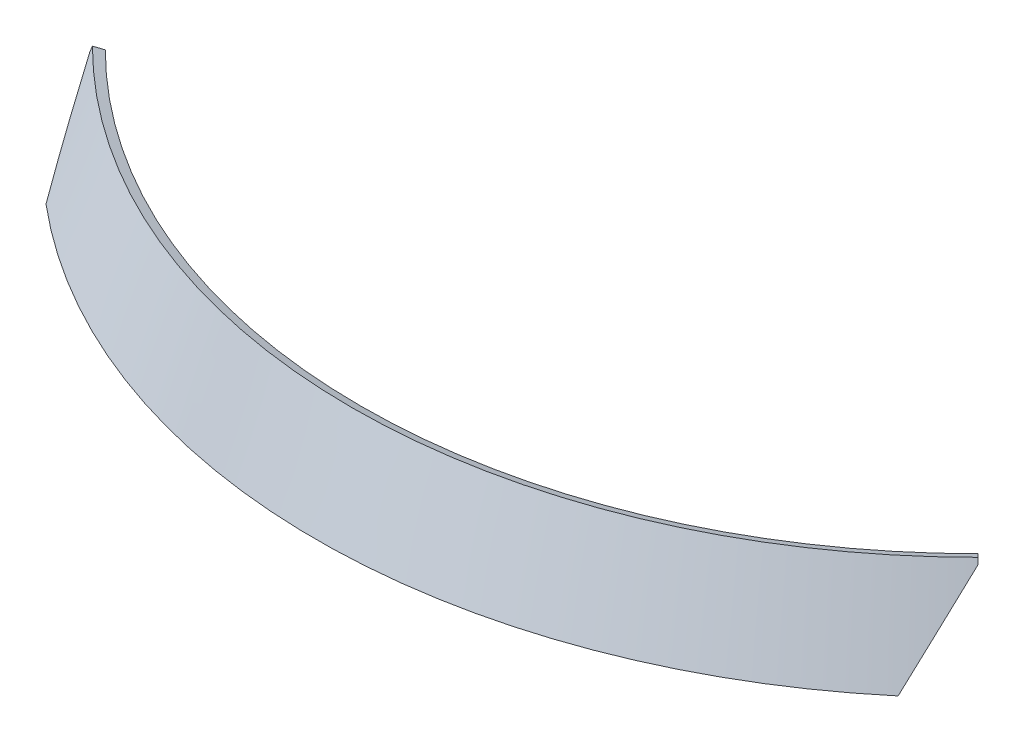
ISO-10303-21;
HEADER;
FILE_DESCRIPTION(('STEP AP214'),'2;1');
FILE_NAME('part.step','',(''),(''),'','','');
FILE_SCHEMA(('AUTOMOTIVE_DESIGN { 1 0 10303 214 1 1 1 1 }'));
ENDSEC;
DATA;
#1=APPLICATION_CONTEXT('core data for automotive mechanical design processes');
#2=APPLICATION_PROTOCOL_DEFINITION('international standard','automotive_design',2000,#1);
#3=PRODUCT_CONTEXT('',#1,'mechanical');
#4=PRODUCT('Part','Part','',(#3));
#5=PRODUCT_RELATED_PRODUCT_CATEGORY('part','',(#4));
#6=PRODUCT_DEFINITION_FORMATION('','',#4);
#7=PRODUCT_DEFINITION_CONTEXT('part definition',#1,'design');
#8=PRODUCT_DEFINITION('design','',#6,#7);
#9=PRODUCT_DEFINITION_SHAPE('','',#8);
#10=(LENGTH_UNIT() NAMED_UNIT(*) SI_UNIT(.MILLI.,.METRE.));
#11=(NAMED_UNIT(*) PLANE_ANGLE_UNIT() SI_UNIT($,.RADIAN.));
#12=(NAMED_UNIT(*) SI_UNIT($,.STERADIAN.) SOLID_ANGLE_UNIT());
#13=UNCERTAINTY_MEASURE_WITH_UNIT(LENGTH_MEASURE(1.E-05),#10,'distance_accuracy_value','');
#14=(GEOMETRIC_REPRESENTATION_CONTEXT(3) GLOBAL_UNCERTAINTY_ASSIGNED_CONTEXT((#13)) GLOBAL_UNIT_ASSIGNED_CONTEXT((#10,
#11,#12)) REPRESENTATION_CONTEXT('',''));
#15=CARTESIAN_POINT('',(0.,0.,0.));
#16=DIRECTION('',(0.,0.,1.));
#17=DIRECTION('',(1.,0.,0.));
#18=AXIS2_PLACEMENT_3D('',#15,#16,#17);
#19=CARTESIAN_POINT('',(102.475807338383,-51.8405545574326,102.461665202759));
#20=DIRECTION('',(0.707106781186546,0.,-0.707106781186549));
#21=DIRECTION('',(-0.707106781186549,0.,-0.707106781186546));
#22=AXIS2_PLACEMENT_3D('',#19,#20,#21);
#23=PLANE('',#22);
#24=CARTESIAN_POINT('',(137.185786618003,7.42461647718073E-13,137.171644482379));
#25=DIRECTION('',(0.24184463948598,-0.939692684181266,0.24184463948598));
#26=VECTOR('',#25,1.);
#27=LINE('',#24,#26);
#28=CARTESIAN_POINT('',(137.184215223104,-7.64684897387979E-09,137.173215784284));
#29=VERTEX_POINT('',#28);
#30=CARTESIAN_POINT('',(137.59332327154,-1.5909724984819,137.583031660133));
#31=VERTEX_POINT('',#30);
#32=EDGE_CURVE('E401',#29,#31,#27,.T.);
#33=ORIENTED_EDGE('',*,*,#32,.T.);
#34=CARTESIAN_POINT('',(135.59780694337,-2.60843124027721,135.587339220933));
#35=CARTESIAN_POINT('',(135.69002345683,-2.56061711371758,135.679046865345));
#36=CARTESIAN_POINT('',(135.782224191703,-2.51289028459415,135.770815948088));
#37=CARTESIAN_POINT('',(135.964012036282,-2.41896108475901,135.951919802834));
#38=CARTESIAN_POINT('',(136.053600109701,-2.37275341661319,136.041250860278));
#39=CARTESIAN_POINT('',(136.230162715626,-2.28186239242355,136.217478518782));
#40=CARTESIAN_POINT('',(136.317138272512,-2.23717343484836,136.304371203791));
#41=CARTESIAN_POINT('',(136.488475789723,-2.14932035264304,136.475722413791));
#42=CARTESIAN_POINT('',(136.57283884535,-2.10615027533361,136.560176791064));
#43=CARTESIAN_POINT('',(136.738951334365,-2.02133531558978,136.726651579694));
#44=CARTESIAN_POINT('',(136.820701940391,-1.97968410173249,136.808667594535));
#45=CARTESIAN_POINT('',(136.98158946687,-1.89790739301199,136.970265959196));
#46=CARTESIAN_POINT('',(137.06072764675,-1.85777514677486,137.049843637965));
#47=CARTESIAN_POINT('',(137.216390317221,-1.77903661235138,137.20656545125));
#48=CARTESIAN_POINT('',(137.292916161679,-1.74042312078384,137.283704620588));
#49=CARTESIAN_POINT('',(137.443353901609,-1.66472348826077,137.43555027401));
#50=CARTESIAN_POINT('',(137.517267264821,-1.62762960719847,137.510251445916));
#51=CARTESIAN_POINT('',(137.591157702123,-1.5906557828645,137.585034732665));
#52=B_SPLINE_CURVE_WITH_KNOTS('',3,(#34,#35,#36,#37,#38,#39,#40,#41,#42,#43,#44,#45,#46,#47,#48,
#49,#50,#51),.UNSPECIFIED.,.F.,.F.,(4,2,2,2,2,2,2,2,4),(0.,0.415696191702338,0.819763919657076,
1.21220439536273,1.5930189435731,1.96220901626367,2.31977620888646,2.6657222793722,
3.00004917044658),.UNSPECIFIED.);
#53=CARTESIAN_POINT('',(135.598059960483,-2.60770232133713,135.586713249244));
#54=VERTEX_POINT('',#53);
#55=EDGE_CURVE('E134',#54,#31,#52,.T.);
#56=ORIENTED_EDGE('',*,*,#55,.F.);
#57=CARTESIAN_POINT('',(135.599398662294,-2.60747157131038,135.58525652667));
#58=DIRECTION('',(-0.241844755973567,0.939692624221437,-0.241844755973567));
#59=VECTOR('',#58,1.);
#60=LINE('',#57,#59);
#61=CARTESIAN_POINT('',(135.190693365206,-1.02606086442858,135.179959763885));
#62=VERTEX_POINT('',#61);
#63=EDGE_CURVE('E130',#54,#62,#60,.T.);
#64=ORIENTED_EDGE('',*,*,#63,.T.);
#65=DIRECTION('',(0.66446302441487,0.342020143223885,0.66446302441487));
#66=VECTOR('',#65,1.);
#67=CARTESIAN_POINT('',(135.192397539428,-1.02606040896335,135.178255403804));
#68=LINE('',#67,#66);
#69=EDGE_CURVE('E416',#62,#29,#68,.T.);
#70=ORIENTED_EDGE('',*,*,#69,.T.);
#71=EDGE_LOOP('',(#33,#56,#64,#70));
#72=FACE_BOUND('',#71,.T.);
#73=ADVANCED_FACE('F52',(#72),#23,.T.);
#74=CARTESIAN_POINT('',(-136.182021013608,-0.513030214988386,136.182021013606));
#75=DIRECTION('',(-0.70710678118655,0.,-0.707106781186545));
#76=DIRECTION('',(-0.707106781186545,0.,0.70710678118655));
#77=AXIS2_PLACEMENT_3D('',#74,#75,#76);
#78=PLANE('',#77);
#79=DIRECTION('',(0.241844762647975,0.939692620785909,-0.241844762647973));
#80=VECTOR('',#79,1.);
#81=CARTESIAN_POINT('',(-142.906301101015,-31.0260604299755,142.906301101014));
#82=LINE('',#81,#80);
#83=CARTESIAN_POINT('',(-135.185326477025,-1.02606042997876,135.185326477024));
#84=VERTEX_POINT('',#83);
#85=CARTESIAN_POINT('',(-135.591427197708,-2.6039728327244,135.591427197707));
#86=VERTEX_POINT('',#85);
#87=EDGE_CURVE('E242',#84,#86,#82,.F.);
#88=ORIENTED_EDGE('',*,*,#87,.T.);
#89=CARTESIAN_POINT('',(-137.585665929148,-1.58130829450576,137.585714626934));
#90=CARTESIAN_POINT('',(-137.502573152416,-1.62392133024904,137.502619822585));
#91=CARTESIAN_POINT('',(-137.419480312361,-1.66653411868624,137.419524954733));
#92=CARTESIAN_POINT('',(-137.253294504102,-1.75175919858638,137.25333509052));
#93=CARTESIAN_POINT('',(-137.170201535898,-1.79437149004931,137.170240094159));
#94=CARTESIAN_POINT('',(-137.004015472516,-1.87959557226662,137.004049974098));
#95=CARTESIAN_POINT('',(-136.920922377338,-1.92220736302101,136.920954850399));
#96=CARTESIAN_POINT('',(-136.75473606118,-2.00743044008693,136.754764476835));
#97=CARTESIAN_POINT('',(-136.671642840201,-2.05004172639849,136.67166922697));
#98=CARTESIAN_POINT('',(-136.505456273615,-2.13526379084452,136.505478602246));
#99=CARTESIAN_POINT('',(-136.422362928008,-2.17787456897903,136.422383227386));
#100=CARTESIAN_POINT('',(-136.256176113341,-2.26309561333669,136.256192353845));
#101=CARTESIAN_POINT('',(-136.17308264428,-2.30570587955988,136.173096855163));
#102=CARTESIAN_POINT('',(-136.00689558388,-2.39092589636064,136.006905735149));
#103=CARTESIAN_POINT('',(-135.92380199254,-2.43353564693826,135.923810113816));
#104=CARTESIAN_POINT('',(-135.757614688753,-2.51875462871361,135.757618749671));
#105=CARTESIAN_POINT('',(-135.674520976307,-2.5613638599114,135.674523006859));
#106=CARTESIAN_POINT('',(-135.591427197708,-2.6039728327245,135.591427197707));
#107=B_SPLINE_CURVE_WITH_KNOTS('',3,(#89,#90,#91,#92,#93,#94,#95,#96,#97,#98,#99,#100,#101,#102,
#103,#104,#105,#106),.UNSPECIFIED.,.F.,.F.,(4,2,2,2,2,2,2,2,4),(0.,0.375000322440445,
0.750000648466122,1.12500096958706,1.50000127731358,1.87500156315661,2.25000181862674,
2.62500203523474,3.00000220449163),.UNSPECIFIED.);
#108=CARTESIAN_POINT('',(-137.585679607828,-1.5813121407463,137.585702915685));
#109=VERTEX_POINT('',#108);
#110=EDGE_CURVE('E181',#109,#86,#107,.T.);
#111=ORIENTED_EDGE('',*,*,#110,.F.);
#112=CARTESIAN_POINT('',(-137.585692809438,-1.58131816615261,137.585692809436));
#113=DIRECTION('',(0.24184476866622,0.939692617688128,-0.24184476866622));
#114=VECTOR('',#113,1.);
#115=LINE('',#112,#114);
#116=CARTESIAN_POINT('',(-137.178715550193,6.31855751650332E-13,137.178715550191));
#117=VERTEX_POINT('',#116);
#118=EDGE_CURVE('E389',#109,#117,#115,.T.);
#119=ORIENTED_EDGE('',*,*,#118,.T.);
#120=DIRECTION('',(0.664463024388678,-0.342020143325669,-0.664463024388671));
#121=VECTOR('',#120,1.);
#122=CARTESIAN_POINT('',(-137.178715550191,0.,137.178715550189));
#123=LINE('',#122,#121);
#124=EDGE_CURVE('E411',#117,#84,#123,.T.);
#125=ORIENTED_EDGE('',*,*,#124,.T.);
#126=EDGE_LOOP('',(#88,#111,#119,#125));
#127=FACE_BOUND('',#126,.T.);
#128=ADVANCED_FACE('F153',(#127),#78,.T.);
#129=CARTESIAN_POINT('',(0.,-31.0260604299775,0.));
#130=DIRECTION('',(0.,-1.,0.));
#131=DIRECTION('',(1.,0.,0.));
#132=AXIS2_PLACEMENT_3D('',#129,#130,#131);
#133=CONICAL_SURFACE('',#132,202.100029165628,0.349065850398863);
#134=CARTESIAN_POINT('',(0.,-31.0260604299772,0.));
#135=DIRECTION('',(0.,1.,0.));
#136=DIRECTION('',(0.,0.,1.));
#137=AXIS2_PLACEMENT_3D('',#134,#135,#136);
#138=CIRCLE('',#137,202.100029165628);
#139=CARTESIAN_POINT('',(-129.980804269902,-31.0260604299772,154.755976653883));
#140=VERTEX_POINT('',#139);
#141=CARTESIAN_POINT('',(129.988901503341,-31.0260604299771,154.749175360331));
#142=VERTEX_POINT('',#141);
#143=EDGE_CURVE('E81',#140,#142,#138,.T.);
#144=ORIENTED_EDGE('',*,*,#143,.F.);
#145=CARTESIAN_POINT('',(-131.520784236387,-23.6285097550328,149.88545855754));
#146=CARTESIAN_POINT('',(-131.328966318937,-24.5662825111724,150.507868082136));
#147=CARTESIAN_POINT('',(-131.135696880095,-25.504733830911,151.128800461435));
#148=CARTESIAN_POINT('',(-130.746299214874,-27.3829347584287,152.367729705995));
#149=CARTESIAN_POINT('',(-130.550171082269,-28.3226843227106,152.985726666666));
#150=CARTESIAN_POINT('',(-129.562407596629,-33.024946491488,156.068693410665));
#151=CARTESIAN_POINT('',(-128.749565889884,-36.797216829229,158.512089980404));
#152=CARTESIAN_POINT('',(-127.498039020054,-42.469866984587,162.144265631108));
#153=CARTESIAN_POINT('',(-127.075455043787,-44.3632586298207,163.349588232138));
#154=CARTESIAN_POINT('',(-126.219800496655,-48.1544870356341,165.749435078514));
#155=CARTESIAN_POINT('',(-125.78673001739,-50.0523237572555,166.943959418057));
#156=CARTESIAN_POINT('',(-125.348538379699,-51.9522918420406,168.133212553945));
#157=B_SPLINE_CURVE_WITH_KNOTS('',3,(#145,#146,#147,#148,#149,#150,#151,#152,#153,#154,#155,
#156),.UNSPECIFIED.,.F.,.F.,(4,2,2,2,2,4),(0.,3.42525625883211,6.85040041186244,
20.5519322084527,27.4036654635756,34.2553388906141),.UNSPECIFIED.);
#158=CARTESIAN_POINT('',(-131.520784699282,-23.6285060516951,149.885464279949));
#159=VERTEX_POINT('',#158);
#160=EDGE_CURVE('E66',#159,#140,#157,.T.);
#161=ORIENTED_EDGE('',*,*,#160,.F.);
#162=CARTESIAN_POINT('',(-135.591427197708,-2.6039728327245,135.591427197707));
#163=CARTESIAN_POINT('',(-135.435446829761,-3.46019812535506,136.188133523507));
#164=CARTESIAN_POINT('',(-135.278083435633,-4.31713435103582,136.783457761298));
#165=CARTESIAN_POINT('',(-134.959876430386,-6.03645506265991,137.974185638684));
#166=CARTESIAN_POINT('',(-134.799019869195,-6.89884613426078,138.569576308709));
#167=CARTESIAN_POINT('',(-134.473822828927,-8.62907644402649,139.760440275995));
#168=CARTESIAN_POINT('',(-134.30946947043,-9.4969221587736,140.355900645399));
#169=CARTESIAN_POINT('',(-133.977274889505,-11.2380619140802,141.546907166657));
#170=CARTESIAN_POINT('',(-133.809420857368,-12.1113623244247,142.142440433116));
#171=CARTESIAN_POINT('',(-133.470220999491,-13.8634115542833,143.333595966323));
#172=CARTESIAN_POINT('',(-133.29886243402,-14.7421666375045,143.929205391467));
#173=CARTESIAN_POINT('',(-132.952649505672,-16.505125328801,145.120516479943));
#174=CARTESIAN_POINT('',(-132.777782472848,-17.3893350957392,145.716205346534));
#175=CARTESIAN_POINT('',(-132.424548616555,-19.1632032000093,146.90767862434));
#176=CARTESIAN_POINT('',(-132.246169193105,-20.0528675921101,147.503450284925));
#177=CARTESIAN_POINT('',(-131.885906308546,-21.8376452250751,148.695092385555));
#178=CARTESIAN_POINT('',(-131.704010316323,-22.7327644187907,149.290950121621));
#179=CARTESIAN_POINT('',(-131.520790660744,-23.6285049058489,149.885463421344));
#180=B_SPLINE_CURVE_WITH_KNOTS('',3,(#162,#163,#164,#165,#166,#167,#168,#169,#170,#171,#172,
#173,#174,#175,#176,#177,#178,#179),.UNSPECIFIED.,.F.,.F.,(4,2,2,2,2,2,2,2,4),(0.,
3.16568718873629,6.34636289941186,9.54208209857079,12.7528991625648,15.9788678917807,
19.2200415248282,22.4764727526923,25.7482137328563),.UNSPECIFIED.);
#181=EDGE_CURVE('E404',#86,#159,#180,.T.);
#182=ORIENTED_EDGE('',*,*,#181,.F.);
#183=ORIENTED_EDGE('',*,*,#87,.F.);
#184=CARTESIAN_POINT('',(0.,-1.02606042997702,0.));
#185=DIRECTION('',(0.,1.,0.));
#186=DIRECTION('',(0.,0.,1.));
#187=AXIS2_PLACEMENT_3D('',#184,#185,#186);
#188=CIRCLE('',#187,191.180922137642);
#189=EDGE_CURVE('E362',#84,#62,#188,.T.);
#190=ORIENTED_EDGE('',*,*,#189,.T.);
#191=ORIENTED_EDGE('',*,*,#63,.F.);
#192=CARTESIAN_POINT('',(131.528643079095,-23.628558151095,149.878598514974));
#193=CARTESIAN_POINT('',(131.711795798476,-22.7330065230924,149.284198542078));
#194=CARTESIAN_POINT('',(131.893625403613,-21.8380759836723,148.688454701028));
#195=CARTESIAN_POINT('',(132.253756965247,-20.0536741990873,147.497040904892));
#196=CARTESIAN_POINT('',(132.43207144721,-19.1641970032776,146.90138364795));
#197=CARTESIAN_POINT('',(132.785176866464,-17.3907018313929,145.710139695919));
#198=CARTESIAN_POINT('',(132.959980398083,-16.5066778028105,145.114565745615));
#199=CARTESIAN_POINT('',(133.306067764803,-14.7440891279207,143.923485012194));
#200=CARTESIAN_POINT('',(133.477364264192,-13.8655183250677,143.32799101997));
#201=CARTESIAN_POINT('',(133.816441425584,-12.1138361955718,142.137066879009));
#202=CARTESIAN_POINT('',(133.984234821657,-11.240718607595,141.541649566025));
#203=CARTESIAN_POINT('',(134.316309561107,-9.49994303656608,140.350875482004));
#204=CARTESIAN_POINT('',(134.48060370853,-8.63227868615824,139.755531590508));
#205=CARTESIAN_POINT('',(134.805683752326,-6.90240964457126,138.564901113149));
#206=CARTESIAN_POINT('',(134.966482522452,-6.04019847929523,137.969627449287));
#207=CARTESIAN_POINT('',(135.284575366399,-4.32123611964727,136.779134122137));
#208=CARTESIAN_POINT('',(135.441882384622,-3.46447834215993,136.183927422562));
#209=CARTESIAN_POINT('',(135.59780694337,-2.60843124027721,135.587339220933));
#210=B_SPLINE_CURVE_WITH_KNOTS('',3,(#192,#193,#194,#195,#196,#197,#198,#199,#200,#201,#202,
#203,#204,#205,#206,#207,#208,#209),.UNSPECIFIED.,.F.,.F.,(4,2,2,2,2,2,2,2,4),(0.,
3.27105655705443,6.52680712036195,9.76730381072052,12.9925992821749,16.2027467361266,
19.3977999354729,22.5778132187825,25.7428415145094),.UNSPECIFIED.);
#211=CARTESIAN_POINT('',(131.528637126855,-23.6285592946203,149.878599373969));
#212=VERTEX_POINT('',#211);
#213=EDGE_CURVE('E122',#212,#54,#210,.T.);
#214=ORIENTED_EDGE('',*,*,#213,.F.);
#215=CARTESIAN_POINT('',(129.158637831675,-34.9138038996423,157.278169786274));
#216=CARTESIAN_POINT('',(129.361739417498,-33.9708382879806,156.667270830454));
#217=CARTESIAN_POINT('',(129.563464145963,-33.0284880493266,156.054963850172));
#218=CARTESIAN_POINT('',(129.964120518664,-31.1450635754325,154.827509631378));
#219=CARTESIAN_POINT('',(130.163052201383,-30.2039893227737,154.212362432154));
#220=CARTESIAN_POINT('',(130.558099535271,-28.3230845597637,152.979152947203));
#221=CARTESIAN_POINT('',(130.75421503161,-27.3832541203554,152.361090503661));
#222=CARTESIAN_POINT('',(131.1435832428,-25.5049095706788,151.12204153959));
#223=CARTESIAN_POINT('',(131.33683591813,-24.5663954787445,150.501054978848));
#224=CARTESIAN_POINT('',(131.52863666619,-23.6285629925138,149.878593660587));
#225=B_SPLINE_CURVE_WITH_KNOTS('',3,(#215,#216,#217,#218,#219,#220,#221,#222,#223,#224),
.UNSPECIFIED.,.F.,.F.,(4,2,2,2,4),(0.,3.4252995089134,6.85055177837744,10.2759916490923,
13.701478764418),.UNSPECIFIED.);
#226=EDGE_CURVE('E118',#212,#142,#225,.F.);
#227=ORIENTED_EDGE('',*,*,#226,.T.);
#228=EDGE_LOOP('',(#144,#161,#182,#183,#190,#191,#214,#227));
#229=FACE_BOUND('',#228,.T.);
#230=ADVANCED_FACE('F128',(#229),#133,.F.);
#231=CARTESIAN_POINT('',(-135.125676046661,-2.84281078795529,135.12567604666));
#232=CARTESIAN_POINT('',(-135.194242491269,-2.80764994358483,135.194242491268));
#233=CARTESIAN_POINT('',(-135.262808935877,-2.77248909921438,135.262808935876));
#234=CARTESIAN_POINT('',(-135.331375380485,-2.73732825484392,135.331375380484));
#235=CARTESIAN_POINT('',(-136.09013683064,-2.34823569775271,136.090136830639));
#236=CARTESIAN_POINT('',(-136.848893323247,-1.9591211693275,136.848893323245));
#237=CARTESIAN_POINT('',(-137.607644411912,-1.56998609116315,137.607644411911));
#238=CARTESIAN_POINT('',(-131.27776972564,-23.8667113058967,149.754507049644));
#239=CARTESIAN_POINT('',(-131.346592159773,-23.8315504615262,149.822858433348));
#240=CARTESIAN_POINT('',(-131.415414593905,-23.7963896171558,149.891209817051));
#241=CARTESIAN_POINT('',(-131.484237028038,-23.7612287727853,149.959561200755));
#242=CARTESIAN_POINT('',(-132.24583127759,-23.3721362156941,150.715942770714));
#243=CARTESIAN_POINT('',(-133.007371545853,-22.9830216872688,151.472357066529));
#244=CARTESIAN_POINT('',(-133.768859842208,-22.5938866091045,152.228801914411));
#245=CARTESIAN_POINT('',(-129.935091479078,-31.2027355040724,154.859052618499));
#246=CARTESIAN_POINT('',(-130.004003237518,-31.167574659702,154.92732895942));
#247=CARTESIAN_POINT('',(-130.072914995958,-31.1324138153315,154.995605300341));
#248=CARTESIAN_POINT('',(-130.141826754397,-31.097252970961,155.063881641262));
#249=CARTESIAN_POINT('',(-130.904409473473,-30.7081604138698,155.819432782125));
#250=CARTESIAN_POINT('',(-131.666921105045,-30.3190458854445,156.575029797991));
#251=CARTESIAN_POINT('',(-132.429364515406,-29.9299108072802,157.330669912319));
#252=B_SPLINE_SURFACE_WITH_KNOTS('',1,3,((#231,#232,#233,#234,#235,#236,#237),(#238,#239,#240,
#241,#242,#243,#244),(#245,#246,#247,#248,#249,#250,#251)),.UNSPECIFIED.,.F.,.F.,.F.,(2,1,2),(4,
3,4),(0.,0.745772254064596,1.0060000503994),(0.998039430923817,0.998348867554575,
1.00177311666107),.UNSPECIFIED.);
#253=CARTESIAN_POINT('',(-129.980804269902,-31.0260604299772,154.755976653883));
#254=CARTESIAN_POINT('',(-130.36205279984,-30.831534432433,155.13372282632));
#255=CARTESIAN_POINT('',(-130.74328582156,-30.6370022718033,155.511481474692));
#256=CARTESIAN_POINT('',(-131.505720848693,-30.2479256243046,156.267023723443));
#257=CARTESIAN_POINT('',(-131.886922854107,-30.0533811374356,156.644807323821));
#258=CARTESIAN_POINT('',(-132.268109351301,-29.8588304874811,157.022603400136));
#259=B_SPLINE_CURVE_WITH_KNOTS('',3,(#253,#254,#255,#256,#257,#258),.UNSPECIFIED.,.F.,.F.,(4,2,
4),(0.,1.71258482216178,3.42516964492453),.UNSPECIFIED.);
#260=CARTESIAN_POINT('',(-131.991508527761,-29.9999999999991,156.748467621583));
#261=VERTEX_POINT('',#260);
#262=EDGE_CURVE('E13',#140,#261,#259,.T.);
#263=CARTESIAN_POINT('',(-137.585666725177,-1.58130382585347,137.585711489353));
#264=CARTESIAN_POINT('',(-137.248667154605,-3.43449686966598,138.876600150564));
#265=CARTESIAN_POINT('',(-136.905295525884,-5.29095578494589,140.161112275422));
#266=CARTESIAN_POINT('',(-136.206168128915,-9.01009319613418,142.717701426894));
#267=CARTESIAN_POINT('',(-135.850412366987,-10.8727716888679,143.989778459855));
#268=CARTESIAN_POINT('',(-134.852650709466,-16.0182161214565,147.481478362766));
#269=CARTESIAN_POINT('',(-134.198075493008,-19.3071591143449,149.688436475883));
#270=CARTESIAN_POINT('',(-133.143419854805,-24.4799364250355,153.122549846388));
#271=CARTESIAN_POINT('',(-132.755301679908,-26.358161526363,154.361869690932));
#272=CARTESIAN_POINT('',(-131.967736496941,-30.1205762849211,156.829697765078));
#273=CARTESIAN_POINT('',(-131.568284484507,-32.0047682400123,158.058200894801));
#274=CARTESIAN_POINT('',(-131.163397308075,-33.8914000685762,159.281152681249));
#275=B_SPLINE_CURVE_WITH_KNOTS('',3,(#263,#264,#265,#266,#267,#268,#269,#270,#271,#272,#273,
#274),.UNSPECIFIED.,.F.,.F.,(4,2,2,2,2,4),(0.,6.8503985745758,13.7007936529866,25.743891786197,
32.5942787027095,39.4477389245476),.UNSPECIFIED.);
#276=EDGE_CURVE('E326',#109,#261,#275,.T.);
#277=ORIENTED_EDGE('',*,*,#181,.T.);
#278=ORIENTED_EDGE('',*,*,#160,.T.);
#279=ORIENTED_EDGE('',*,*,#262,.T.);
#280=ORIENTED_EDGE('',*,*,#276,.F.);
#281=ORIENTED_EDGE('',*,*,#110,.T.);
#282=EDGE_LOOP('',(#277,#278,#279,#280,#281));
#283=FACE_BOUND('',#282,.T.);
#284=ADVANCED_FACE('F152',(#283),#252,.T.);
#285=CARTESIAN_POINT('',(0.,-29.9999999999996,0.));
#286=DIRECTION('',(0.,1.,0.));
#287=DIRECTION('',(0.,0.,1.));
#288=AXIS2_PLACEMENT_3D('',#285,#286,#287);
#289=CONICAL_SURFACE('',#288,204.919107027987,1.22173047639603);
#290=ORIENTED_EDGE('',*,*,#143,.T.);
#291=CARTESIAN_POINT('',(131.99959036451,-29.9999999999992,156.741661879507));
#292=CARTESIAN_POINT('',(131.618465356253,-30.1945133551332,156.363940490132));
#293=CARTESIAN_POINT('',(131.237325955661,-30.3890205672118,155.9862304613));
#294=CARTESIAN_POINT('',(130.475018369884,-30.7780227052196,155.230833124796));
#295=CARTESIAN_POINT('',(130.093850184698,-30.9725176311489,154.853145817124));
#296=CARTESIAN_POINT('',(129.712667607178,-31.1670064140226,154.475469869995));
#297=B_SPLINE_CURVE_WITH_KNOTS('',3,(#291,#292,#293,#294,#295,#296),.UNSPECIFIED.,.F.,.F.,(4,2,
4),(0.,1.71227523401703,3.42455046769846),.UNSPECIFIED.);
#298=CARTESIAN_POINT('',(131.99959036451,-29.9999999999992,156.741661879507));
#299=VERTEX_POINT('',#298);
#300=EDGE_CURVE('E124',#299,#142,#297,.T.);
#301=ORIENTED_EDGE('',*,*,#300,.F.);
#302=CARTESIAN_POINT('',(0.,-30.0000000002544,0.));
#303=DIRECTION('',(0.,-1.,0.));
#304=DIRECTION('',(1.,0.,0.));
#305=AXIS2_PLACEMENT_3D('',#302,#303,#304);
#306=CIRCLE('',#305,204.919107028082);
#307=EDGE_CURVE('E73',#261,#299,#306,.F.);
#308=ORIENTED_EDGE('',*,*,#307,.F.);
#309=ORIENTED_EDGE('',*,*,#262,.F.);
#310=EDGE_LOOP('',(#290,#301,#308,#309));
#311=FACE_BOUND('',#310,.T.);
#312=ADVANCED_FACE('F154',(#311),#289,.T.);
#313=CARTESIAN_POINT('',(129.943188114182,-31.2027331355107,154.852242275013));
#314=CARTESIAN_POINT('',(130.012054581447,-31.1675951275821,154.920474118132));
#315=CARTESIAN_POINT('',(130.080921048712,-31.1324571196535,154.98870596125));
#316=CARTESIAN_POINT('',(130.149787515977,-31.0973191117249,155.056937804369));
#317=CARTESIAN_POINT('',(130.912229767957,-30.7082952085245,155.812353933435));
#318=CARTESIAN_POINT('',(131.674601008095,-30.3192493679661,156.567815902397));
#319=CARTESIAN_POINT('',(132.436904109167,-29.9301830042359,157.323320947369));
#320=CARTESIAN_POINT('',(131.285761929442,-23.8666949829287,149.747776857421));
#321=CARTESIAN_POINT('',(131.354539188059,-23.8315569750001,149.816083654093));
#322=CARTESIAN_POINT('',(131.423316446677,-23.7964189670715,149.884390450765));
#323=CARTESIAN_POINT('',(131.492093705294,-23.7612809591429,149.952697247437));
#324=CARTESIAN_POINT('',(132.253548300361,-23.3722570559425,150.708943210796));
#325=CARTESIAN_POINT('',(133.014948972431,-22.9832112153841,151.465221876124));
#326=CARTESIAN_POINT('',(133.776297738383,-22.5941448516539,152.221531081712));
#327=CARTESIAN_POINT('',(135.133358288687,-2.8428128199367,135.119216153063));
#328=CARTESIAN_POINT('',(135.20187988995,-2.8076748120081,135.187737754326));
#329=CARTESIAN_POINT('',(135.270401491214,-2.77253680407949,135.25625935559));
#330=CARTESIAN_POINT('',(135.338923092477,-2.73739879615089,135.324780956853));
#331=CARTESIAN_POINT('',(136.097547224818,-2.34837489295045,136.083405089193));
#332=CARTESIAN_POINT('',(136.856166407987,-1.95932905239202,136.842024272362));
#333=CARTESIAN_POINT('',(137.614780206007,-1.57026268866188,137.600638070383));
#334=B_SPLINE_SURFACE_WITH_KNOTS('',1,3,((#313,#314,#315,#316,#317,#318,#319),(#320,#321,#322,
#323,#324,#325,#326),(#327,#328,#329,#330,#331,#332,#333)),.UNSPECIFIED.,.F.,.F.,.F.,(2,1,2),(4,
3,4),(-0.00599989430072856,0.254228397033038,1.),(0.998221670530702,0.998530904952229,
1.00195453619253),.UNSPECIFIED.);
#335=CARTESIAN_POINT('',(127.387709573389,-50.9211872829545,170.12638269609));
#336=CARTESIAN_POINT('',(127.823701046558,-49.0221899397285,168.936439775122));
#337=CARTESIAN_POINT('',(128.254649816506,-47.1252723146543,167.741288515718));
#338=CARTESIAN_POINT('',(129.531995673847,-41.441047848648,164.139827306053));
#339=CARTESIAN_POINT('',(130.362875655536,-37.6603404183051,161.717553908192));
#340=CARTESIAN_POINT('',(131.576681793945,-32.0035776296688,158.050646224325));
#341=CARTESIAN_POINT('',(131.97589939613,-30.1202039269048,156.822648501078));
#342=CARTESIAN_POINT('',(132.763205855405,-26.3584717760301,154.35522069384));
#343=CARTESIAN_POINT('',(133.151294119469,-24.48011359999,153.115790005279));
#344=CARTESIAN_POINT('',(133.91592323126,-20.7292535844272,150.625610534303));
#345=CARTESIAN_POINT('',(134.292466947425,-18.8567503956893,149.374864665017));
#346=CARTESIAN_POINT('',(135.033791291674,-15.1174096743204,146.861471177842));
#347=CARTESIAN_POINT('',(135.398571914786,-13.2505721440844,145.598823554924));
#348=CARTESIAN_POINT('',(136.387652635859,-8.11154799391304,142.100618660165));
#349=CARTESIAN_POINT('',(136.99931143896,-4.84559451243203,139.852321311248));
#350=CARTESIAN_POINT('',(137.591333785751,-1.58968616795842,137.584358997101));
#351=B_SPLINE_CURVE_WITH_KNOTS('',3,(#335,#336,#337,#338,#339,#340,#341,#342,#343,#344,#345,
#346,#347,#348,#349,#350),.UNSPECIFIED.,.F.,.F.,(4,2,2,2,2,2,2,4),(0.,6.84913904430855,
20.5476726065185,27.3981748244145,34.2490413951637,41.0981917256574,47.9473449510629,
59.9827190832514),.UNSPECIFIED.);
#352=EDGE_CURVE('E324',#299,#31,#351,.T.);
#353=ORIENTED_EDGE('',*,*,#352,.F.);
#354=ORIENTED_EDGE('',*,*,#300,.T.);
#355=ORIENTED_EDGE('',*,*,#226,.F.);
#356=ORIENTED_EDGE('',*,*,#213,.T.);
#357=ORIENTED_EDGE('',*,*,#55,.T.);
#358=EDGE_LOOP('',(#353,#354,#355,#356,#357));
#359=FACE_BOUND('',#358,.T.);
#360=ADVANCED_FACE('F120',(#359),#334,.T.);
#361=CARTESIAN_POINT('',(0.,1.78853919808267E-12,0.));
#362=DIRECTION('',(0.,1.,0.));
#363=DIRECTION('',(0.,0.,1.));
#364=AXIS2_PLACEMENT_3D('',#361,#362,#363);
#365=CONICAL_SURFACE('',#364,194.000000000005,1.22173047639603);
#366=ORIENTED_EDGE('',*,*,#189,.F.);
#367=ORIENTED_EDGE('',*,*,#124,.F.);
#368=CARTESIAN_POINT('',(0.,-2.07068806545863E-08,0.));
#369=DIRECTION('',(0.,-1.,0.));
#370=DIRECTION('',(1.,0.,0.));
#371=AXIS2_PLACEMENT_3D('',#368,#369,#370);
#372=CIRCLE('',#371,194.00000000754);
#373=EDGE_CURVE('E399',#29,#117,#372,.T.);
#374=ORIENTED_EDGE('',*,*,#373,.F.);
#375=ORIENTED_EDGE('',*,*,#69,.F.);
#376=EDGE_LOOP('',(#366,#367,#374,#375));
#377=FACE_BOUND('',#376,.T.);
#378=ADVANCED_FACE('F332',(#377),#365,.F.);
#379=CARTESIAN_POINT('',(0.,-30.0000000002544,0.));
#380=DIRECTION('',(0.,-1.,0.));
#381=DIRECTION('',(1.,0.,0.));
#382=AXIS2_PLACEMENT_3D('',#379,#380,#381);
#383=CONICAL_SURFACE('',#382,204.919107028082,0.349065850398863);
#384=ORIENTED_EDGE('',*,*,#373,.T.);
#385=ORIENTED_EDGE('',*,*,#118,.F.);
#386=ORIENTED_EDGE('',*,*,#276,.T.);
#387=ORIENTED_EDGE('',*,*,#307,.T.);
#388=ORIENTED_EDGE('',*,*,#352,.T.);
#389=ORIENTED_EDGE('',*,*,#32,.F.);
#390=EDGE_LOOP('',(#384,#385,#386,#387,#388,#389));
#391=FACE_BOUND('',#390,.T.);
#392=ADVANCED_FACE('F329',(#391),#383,.T.);
#393=CLOSED_SHELL('',(#73,#128,#230,#284,#312,#360,#378,#392));
#394=MANIFOLD_SOLID_BREP('B2',#393);
#395=ADVANCED_BREP_SHAPE_REPRESENTATION('',(#18,#394),#14);
#396=SHAPE_DEFINITION_REPRESENTATION(#9,#395);
ENDSEC;
END-ISO-10303-21;
